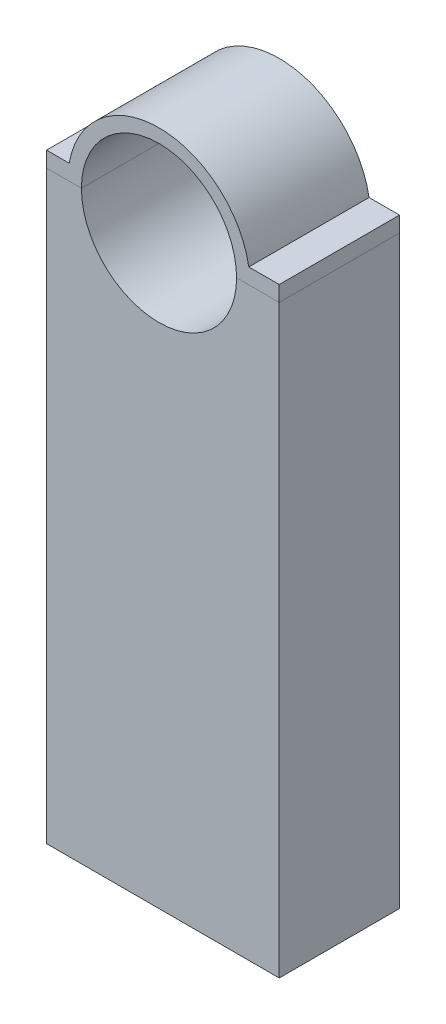
ISO-10303-21;
HEADER;
FILE_DESCRIPTION(('STEP AP214'),'2;1');
FILE_NAME('part.step','',(''),(''),'','','');
FILE_SCHEMA(('AUTOMOTIVE_DESIGN { 1 0 10303 214 1 1 1 1 }'));
ENDSEC;
DATA;
#1=APPLICATION_CONTEXT('core data for automotive mechanical design processes');
#2=APPLICATION_PROTOCOL_DEFINITION('international standard','automotive_design',2000,#1);
#3=PRODUCT_CONTEXT('',#1,'mechanical');
#4=PRODUCT('Part','Part','',(#3));
#5=PRODUCT_RELATED_PRODUCT_CATEGORY('part','',(#4));
#6=PRODUCT_DEFINITION_FORMATION('','',#4);
#7=PRODUCT_DEFINITION_CONTEXT('part definition',#1,'design');
#8=PRODUCT_DEFINITION('design','',#6,#7);
#9=PRODUCT_DEFINITION_SHAPE('','',#8);
#10=(LENGTH_UNIT() NAMED_UNIT(*) SI_UNIT(.MILLI.,.METRE.));
#11=(NAMED_UNIT(*) PLANE_ANGLE_UNIT() SI_UNIT($,.RADIAN.));
#12=(NAMED_UNIT(*) SI_UNIT($,.STERADIAN.) SOLID_ANGLE_UNIT());
#13=UNCERTAINTY_MEASURE_WITH_UNIT(LENGTH_MEASURE(1.E-05),#10,'distance_accuracy_value','');
#14=(GEOMETRIC_REPRESENTATION_CONTEXT(3) GLOBAL_UNCERTAINTY_ASSIGNED_CONTEXT((#13)) GLOBAL_UNIT_ASSIGNED_CONTEXT((#10,
#11,#12)) REPRESENTATION_CONTEXT('',''));
#15=CARTESIAN_POINT('',(0.,0.,0.));
#16=DIRECTION('',(0.,0.,1.));
#17=DIRECTION('',(1.,0.,0.));
#18=AXIS2_PLACEMENT_3D('',#15,#16,#17);
#19=CARTESIAN_POINT('',(-10.020325203252,141.99593495935,0.));
#20=DIRECTION('',(0.,-1.,0.));
#21=DIRECTION('',(0.,0.,-1.));
#22=AXIS2_PLACEMENT_3D('',#19,#20,#21);
#23=PLANE('',#22);
#24=DIRECTION('',(1.,0.,0.));
#25=VECTOR('',#24,1.);
#26=CARTESIAN_POINT('',(-10.020325203252,141.99593495935,31.));
#27=LINE('',#26,#25);
#28=CARTESIAN_POINT('',(-10.020325203252,141.99593495935,31.));
#29=VERTEX_POINT('',#28);
#30=CARTESIAN_POINT('',(-1.02032520325204,141.99593495935,31.));
#31=VERTEX_POINT('',#30);
#32=EDGE_CURVE('E142',#29,#31,#27,.T.);
#33=ORIENTED_EDGE('',*,*,#32,.F.);
#34=DIRECTION('',(0.,0.,1.));
#35=VECTOR('',#34,1.);
#36=CARTESIAN_POINT('',(-10.020325203252,141.99593495935,0.));
#37=LINE('',#36,#35);
#38=CARTESIAN_POINT('',(-10.020325203252,141.99593495935,0.));
#39=VERTEX_POINT('',#38);
#40=EDGE_CURVE('E12',#39,#29,#37,.T.);
#41=ORIENTED_EDGE('',*,*,#40,.F.);
#42=DIRECTION('',(1.,0.,0.));
#43=VECTOR('',#42,1.);
#44=CARTESIAN_POINT('',(-10.020325203252,141.99593495935,0.));
#45=LINE('',#44,#43);
#46=CARTESIAN_POINT('',(-1.02032520325204,141.99593495935,0.));
#47=VERTEX_POINT('',#46);
#48=EDGE_CURVE('E162',#39,#47,#45,.T.);
#49=ORIENTED_EDGE('',*,*,#48,.T.);
#50=DIRECTION('',(0.,0.,1.));
#51=VECTOR('',#50,1.);
#52=CARTESIAN_POINT('',(-1.02032520325204,141.99593495935,0.));
#53=LINE('',#52,#51);
#54=EDGE_CURVE('E48',#47,#31,#53,.T.);
#55=ORIENTED_EDGE('',*,*,#54,.T.);
#56=EDGE_LOOP('',(#33,#41,#49,#55));
#57=FACE_BOUND('',#56,.T.);
#58=ADVANCED_FACE('F45',(#57),#23,.T.);
#59=CARTESIAN_POINT('',(-10.020325203252,141.99593495935,0.));
#60=DIRECTION('',(-1.,0.,0.));
#61=DIRECTION('',(0.,0.,1.));
#62=AXIS2_PLACEMENT_3D('',#59,#60,#61);
#63=PLANE('',#62);
#64=DIRECTION('',(0.,-1.,0.));
#65=VECTOR('',#64,1.);
#66=CARTESIAN_POINT('',(-10.020325203252,141.99593495935,31.));
#67=LINE('',#66,#65);
#68=CARTESIAN_POINT('',(-10.020325203252,145.99593495935,31.));
#69=VERTEX_POINT('',#68);
#70=EDGE_CURVE('E160',#69,#29,#67,.T.);
#71=ORIENTED_EDGE('',*,*,#70,.F.);
#72=DIRECTION('',(0.,0.,1.));
#73=VECTOR('',#72,1.);
#74=CARTESIAN_POINT('',(-10.020325203252,145.99593495935,0.));
#75=LINE('',#74,#73);
#76=CARTESIAN_POINT('',(-10.020325203252,145.99593495935,0.));
#77=VERTEX_POINT('',#76);
#78=EDGE_CURVE('E54',#77,#69,#75,.T.);
#79=ORIENTED_EDGE('',*,*,#78,.F.);
#80=DIRECTION('',(0.,-1.,0.));
#81=VECTOR('',#80,1.);
#82=CARTESIAN_POINT('',(-10.020325203252,141.99593495935,0.));
#83=LINE('',#82,#81);
#84=EDGE_CURVE('E132',#77,#39,#83,.T.);
#85=ORIENTED_EDGE('',*,*,#84,.T.);
#86=ORIENTED_EDGE('',*,*,#40,.T.);
#87=EDGE_LOOP('',(#71,#79,#85,#86));
#88=FACE_BOUND('',#87,.T.);
#89=ADVANCED_FACE('F174',(#88),#63,.T.);
#90=CARTESIAN_POINT('',(-10.020325203252,145.99593495935,0.));
#91=DIRECTION('',(0.,1.,0.));
#92=DIRECTION('',(0.,0.,1.));
#93=AXIS2_PLACEMENT_3D('',#90,#91,#92);
#94=PLANE('',#93);
#95=DIRECTION('',(-1.,0.,0.));
#96=VECTOR('',#95,1.);
#97=CARTESIAN_POINT('',(-10.020325203252,145.99593495935,31.));
#98=LINE('',#97,#96);
#99=CARTESIAN_POINT('',(-4.17739755707086,145.99593495935,31.));
#100=VERTEX_POINT('',#99);
#101=EDGE_CURVE('E119',#100,#69,#98,.T.);
#102=ORIENTED_EDGE('',*,*,#101,.F.);
#103=DIRECTION('',(0.,0.,1.));
#104=VECTOR('',#103,1.);
#105=CARTESIAN_POINT('',(-4.17739755707086,145.99593495935,0.));
#106=LINE('',#105,#104);
#107=CARTESIAN_POINT('',(-4.17739755707086,145.99593495935,0.));
#108=VERTEX_POINT('',#107);
#109=EDGE_CURVE('E114',#108,#100,#106,.T.);
#110=ORIENTED_EDGE('',*,*,#109,.F.);
#111=DIRECTION('',(-1.,0.,0.));
#112=VECTOR('',#111,1.);
#113=CARTESIAN_POINT('',(-10.020325203252,145.99593495935,0.));
#114=LINE('',#113,#112);
#115=EDGE_CURVE('E117',#108,#77,#114,.T.);
#116=ORIENTED_EDGE('',*,*,#115,.T.);
#117=ORIENTED_EDGE('',*,*,#78,.T.);
#118=EDGE_LOOP('',(#102,#110,#116,#117));
#119=FACE_BOUND('',#118,.T.);
#120=ADVANCED_FACE('F116',(#119),#94,.T.);
#121=CARTESIAN_POINT('',(18.979674796748,141.99593495935,0.));
#122=DIRECTION('',(0.,0.,1.));
#123=DIRECTION('',(1.,0.,0.));
#124=AXIS2_PLACEMENT_3D('',#121,#122,#123);
#125=CYLINDRICAL_SURFACE('',#124,23.5);
#126=CARTESIAN_POINT('',(18.979674796748,141.99593495935,31.));
#127=DIRECTION('',(0.,0.,1.));
#128=DIRECTION('',(1.,0.,0.));
#129=AXIS2_PLACEMENT_3D('',#126,#127,#128);
#130=CIRCLE('',#129,23.5);
#131=CARTESIAN_POINT('',(42.1367471505668,145.99593495935,31.));
#132=VERTEX_POINT('',#131);
#133=EDGE_CURVE('E157',#132,#100,#130,.T.);
#134=ORIENTED_EDGE('',*,*,#133,.F.);
#135=DIRECTION('',(0.,0.,1.));
#136=VECTOR('',#135,1.);
#137=CARTESIAN_POINT('',(42.1367471505668,145.99593495935,0.));
#138=LINE('',#137,#136);
#139=CARTESIAN_POINT('',(42.1367471505668,145.99593495935,0.));
#140=VERTEX_POINT('',#139);
#141=EDGE_CURVE('E124',#140,#132,#138,.T.);
#142=ORIENTED_EDGE('',*,*,#141,.F.);
#143=CARTESIAN_POINT('',(18.979674796748,141.99593495935,0.));
#144=DIRECTION('',(0.,0.,1.));
#145=DIRECTION('',(1.,0.,0.));
#146=AXIS2_PLACEMENT_3D('',#143,#144,#145);
#147=CIRCLE('',#146,23.5);
#148=EDGE_CURVE('E130',#140,#108,#147,.T.);
#149=ORIENTED_EDGE('',*,*,#148,.T.);
#150=ORIENTED_EDGE('',*,*,#109,.T.);
#151=EDGE_LOOP('',(#134,#142,#149,#150));
#152=FACE_BOUND('',#151,.T.);
#153=ADVANCED_FACE('F134',(#152),#125,.T.);
#154=CARTESIAN_POINT('',(42.1367471505668,145.99593495935,0.));
#155=DIRECTION('',(0.,1.,0.));
#156=DIRECTION('',(0.,0.,1.));
#157=AXIS2_PLACEMENT_3D('',#154,#155,#156);
#158=PLANE('',#157);
#159=DIRECTION('',(-1.,0.,0.));
#160=VECTOR('',#159,1.);
#161=CARTESIAN_POINT('',(42.1367471505668,145.99593495935,31.));
#162=LINE('',#161,#160);
#163=CARTESIAN_POINT('',(49.979674796748,145.99593495935,31.));
#164=VERTEX_POINT('',#163);
#165=EDGE_CURVE('E154',#164,#132,#162,.T.);
#166=ORIENTED_EDGE('',*,*,#165,.F.);
#167=DIRECTION('',(0.,0.,1.));
#168=VECTOR('',#167,1.);
#169=CARTESIAN_POINT('',(49.979674796748,145.99593495935,0.));
#170=LINE('',#169,#168);
#171=CARTESIAN_POINT('',(49.979674796748,145.99593495935,0.));
#172=VERTEX_POINT('',#171);
#173=EDGE_CURVE('E166',#172,#164,#170,.T.);
#174=ORIENTED_EDGE('',*,*,#173,.F.);
#175=DIRECTION('',(-1.,0.,0.));
#176=VECTOR('',#175,1.);
#177=CARTESIAN_POINT('',(42.1367471505668,145.99593495935,0.));
#178=LINE('',#177,#176);
#179=EDGE_CURVE('E135',#172,#140,#178,.T.);
#180=ORIENTED_EDGE('',*,*,#179,.T.);
#181=ORIENTED_EDGE('',*,*,#141,.T.);
#182=EDGE_LOOP('',(#166,#174,#180,#181));
#183=FACE_BOUND('',#182,.T.);
#184=ADVANCED_FACE('F187',(#183),#158,.T.);
#185=CARTESIAN_POINT('',(49.979674796748,141.99593495935,0.));
#186=DIRECTION('',(1.,0.,0.));
#187=DIRECTION('',(0.,0.,-1.));
#188=AXIS2_PLACEMENT_3D('',#185,#186,#187);
#189=PLANE('',#188);
#190=DIRECTION('',(0.,1.,0.));
#191=VECTOR('',#190,1.);
#192=CARTESIAN_POINT('',(49.979674796748,141.99593495935,31.));
#193=LINE('',#192,#191);
#194=CARTESIAN_POINT('',(49.979674796748,141.99593495935,31.));
#195=VERTEX_POINT('',#194);
#196=EDGE_CURVE('E151',#195,#164,#193,.T.);
#197=ORIENTED_EDGE('',*,*,#196,.F.);
#198=DIRECTION('',(0.,0.,1.));
#199=VECTOR('',#198,1.);
#200=CARTESIAN_POINT('',(49.979674796748,141.99593495935,0.));
#201=LINE('',#200,#199);
#202=CARTESIAN_POINT('',(49.979674796748,141.99593495935,0.));
#203=VERTEX_POINT('',#202);
#204=EDGE_CURVE('E168',#203,#195,#201,.T.);
#205=ORIENTED_EDGE('',*,*,#204,.F.);
#206=DIRECTION('',(0.,1.,0.));
#207=VECTOR('',#206,1.);
#208=CARTESIAN_POINT('',(49.979674796748,141.99593495935,0.));
#209=LINE('',#208,#207);
#210=EDGE_CURVE('E137',#203,#172,#209,.T.);
#211=ORIENTED_EDGE('',*,*,#210,.T.);
#212=ORIENTED_EDGE('',*,*,#173,.T.);
#213=EDGE_LOOP('',(#197,#205,#211,#212));
#214=FACE_BOUND('',#213,.T.);
#215=ADVANCED_FACE('F190',(#214),#189,.T.);
#216=CARTESIAN_POINT('',(38.979674796748,141.99593495935,0.));
#217=DIRECTION('',(0.,-1.,0.));
#218=DIRECTION('',(0.,0.,-1.));
#219=AXIS2_PLACEMENT_3D('',#216,#217,#218);
#220=PLANE('',#219);
#221=DIRECTION('',(1.,0.,0.));
#222=VECTOR('',#221,1.);
#223=CARTESIAN_POINT('',(38.979674796748,141.99593495935,31.));
#224=LINE('',#223,#222);
#225=CARTESIAN_POINT('',(38.979674796748,141.99593495935,31.));
#226=VERTEX_POINT('',#225);
#227=EDGE_CURVE('E148',#226,#195,#224,.T.);
#228=ORIENTED_EDGE('',*,*,#227,.F.);
#229=DIRECTION('',(0.,0.,1.));
#230=VECTOR('',#229,1.);
#231=CARTESIAN_POINT('',(38.979674796748,141.99593495935,0.));
#232=LINE('',#231,#230);
#233=CARTESIAN_POINT('',(38.979674796748,141.99593495935,0.));
#234=VERTEX_POINT('',#233);
#235=EDGE_CURVE('E169',#234,#226,#232,.T.);
#236=ORIENTED_EDGE('',*,*,#235,.F.);
#237=DIRECTION('',(1.,0.,0.));
#238=VECTOR('',#237,1.);
#239=CARTESIAN_POINT('',(38.979674796748,141.99593495935,0.));
#240=LINE('',#239,#238);
#241=EDGE_CURVE('E265',#234,#203,#240,.T.);
#242=ORIENTED_EDGE('',*,*,#241,.T.);
#243=ORIENTED_EDGE('',*,*,#204,.T.);
#244=EDGE_LOOP('',(#228,#236,#242,#243));
#245=FACE_BOUND('',#244,.T.);
#246=ADVANCED_FACE('F194',(#245),#220,.T.);
#247=CARTESIAN_POINT('',(18.979674796748,141.99593495935,0.));
#248=DIRECTION('',(0.,0.,1.));
#249=DIRECTION('',(1.,0.,0.));
#250=AXIS2_PLACEMENT_3D('',#247,#248,#249);
#251=CYLINDRICAL_SURFACE('',#250,20.);
#252=CARTESIAN_POINT('',(18.979674796748,141.99593495935,31.));
#253=DIRECTION('',(0.,0.,-1.));
#254=DIRECTION('',(1.,0.,0.));
#255=AXIS2_PLACEMENT_3D('',#252,#253,#254);
#256=CIRCLE('',#255,20.);
#257=EDGE_CURVE('E145',#31,#226,#256,.T.);
#258=ORIENTED_EDGE('',*,*,#257,.F.);
#259=ORIENTED_EDGE('',*,*,#54,.F.);
#260=CARTESIAN_POINT('',(18.979674796748,141.99593495935,0.));
#261=DIRECTION('',(0.,0.,-1.));
#262=DIRECTION('',(1.,0.,0.));
#263=AXIS2_PLACEMENT_3D('',#260,#261,#262);
#264=CIRCLE('',#263,20.);
#265=EDGE_CURVE('E266',#47,#234,#264,.T.);
#266=ORIENTED_EDGE('',*,*,#265,.T.);
#267=ORIENTED_EDGE('',*,*,#235,.T.);
#268=EDGE_LOOP('',(#258,#259,#266,#267));
#269=FACE_BOUND('',#268,.T.);
#270=ADVANCED_FACE('F171',(#269),#251,.F.);
#271=CARTESIAN_POINT('',(18.979674796748,141.99593495935,0.));
#272=DIRECTION('',(0.,0.,1.));
#273=DIRECTION('',(1.,0.,0.));
#274=AXIS2_PLACEMENT_3D('',#271,#272,#273);
#275=PLANE('',#274);
#276=ORIENTED_EDGE('',*,*,#48,.F.);
#277=ORIENTED_EDGE('',*,*,#84,.F.);
#278=ORIENTED_EDGE('',*,*,#115,.F.);
#279=ORIENTED_EDGE('',*,*,#148,.F.);
#280=ORIENTED_EDGE('',*,*,#179,.F.);
#281=ORIENTED_EDGE('',*,*,#210,.F.);
#282=ORIENTED_EDGE('',*,*,#241,.F.);
#283=ORIENTED_EDGE('',*,*,#265,.F.);
#284=EDGE_LOOP('',(#276,#277,#278,#279,#280,#281,#282,#283));
#285=FACE_BOUND('',#284,.T.);
#286=ADVANCED_FACE('F128',(#285),#275,.F.);
#287=CARTESIAN_POINT('',(18.979674796748,141.99593495935,31.));
#288=DIRECTION('',(0.,0.,1.));
#289=DIRECTION('',(1.,0.,0.));
#290=AXIS2_PLACEMENT_3D('',#287,#288,#289);
#291=PLANE('',#290);
#292=ORIENTED_EDGE('',*,*,#32,.T.);
#293=ORIENTED_EDGE('',*,*,#257,.T.);
#294=ORIENTED_EDGE('',*,*,#227,.T.);
#295=ORIENTED_EDGE('',*,*,#196,.T.);
#296=ORIENTED_EDGE('',*,*,#165,.T.);
#297=ORIENTED_EDGE('',*,*,#133,.T.);
#298=ORIENTED_EDGE('',*,*,#101,.T.);
#299=ORIENTED_EDGE('',*,*,#70,.T.);
#300=EDGE_LOOP('',(#292,#293,#294,#295,#296,#297,#298,#299));
#301=FACE_BOUND('',#300,.T.);
#302=ADVANCED_FACE('F173',(#301),#291,.T.);
#303=CLOSED_SHELL('',(#58,#89,#120,#153,#184,#215,#246,#270,#286,#302));
#304=MANIFOLD_SOLID_BREP('B2',#303);
#305=CARTESIAN_POINT('',(-10.020325203252,141.99593495935,31.));
#306=DIRECTION('',(1.,0.,0.));
#307=DIRECTION('',(0.,1.,0.));
#308=AXIS2_PLACEMENT_3D('',#305,#306,#307);
#309=PLANE('',#308);
#310=DIRECTION('',(0.,-1.,0.));
#311=VECTOR('',#310,1.);
#312=CARTESIAN_POINT('',(-10.020325203252,141.99593495935,0.));
#313=LINE('',#312,#311);
#314=CARTESIAN_POINT('',(-10.020325203252,141.99593495935,0.));
#315=VERTEX_POINT('',#314);
#316=CARTESIAN_POINT('',(-10.020325203252,-8.84406504065041,0.));
#317=VERTEX_POINT('',#316);
#318=EDGE_CURVE('E356',#315,#317,#313,.T.);
#319=ORIENTED_EDGE('',*,*,#318,.T.);
#320=DIRECTION('',(0.,0.,-1.));
#321=VECTOR('',#320,1.);
#322=CARTESIAN_POINT('',(-10.020325203252,-8.84406504065041,31.));
#323=LINE('',#322,#321);
#324=CARTESIAN_POINT('',(-10.020325203252,-8.84406504065041,31.));
#325=VERTEX_POINT('',#324);
#326=EDGE_CURVE('E43',#325,#317,#323,.T.);
#327=ORIENTED_EDGE('',*,*,#326,.F.);
#328=DIRECTION('',(0.,-1.,0.));
#329=VECTOR('',#328,1.);
#330=CARTESIAN_POINT('',(-10.020325203252,141.99593495935,31.));
#331=LINE('',#330,#329);
#332=CARTESIAN_POINT('',(-10.020325203252,141.99593495935,31.));
#333=VERTEX_POINT('',#332);
#334=EDGE_CURVE('E366',#333,#325,#331,.T.);
#335=ORIENTED_EDGE('',*,*,#334,.F.);
#336=DIRECTION('',(0.,0.,-1.));
#337=VECTOR('',#336,1.);
#338=CARTESIAN_POINT('',(-10.020325203252,141.99593495935,31.));
#339=LINE('',#338,#337);
#340=EDGE_CURVE('E352',#333,#315,#339,.T.);
#341=ORIENTED_EDGE('',*,*,#340,.T.);
#342=EDGE_LOOP('',(#319,#327,#335,#341));
#343=FACE_BOUND('',#342,.T.);
#344=ADVANCED_FACE('F272',(#343),#309,.F.);
#345=CARTESIAN_POINT('',(-10.020325203252,-8.84406504065041,31.));
#346=DIRECTION('',(0.,1.,0.));
#347=DIRECTION('',(0.,0.,1.));
#348=AXIS2_PLACEMENT_3D('',#345,#346,#347);
#349=PLANE('',#348);
#350=DIRECTION('',(1.,0.,0.));
#351=VECTOR('',#350,1.);
#352=CARTESIAN_POINT('',(-10.020325203252,-8.84406504065041,0.));
#353=LINE('',#352,#351);
#354=CARTESIAN_POINT('',(49.979674796748,-8.84406504065041,0.));
#355=VERTEX_POINT('',#354);
#356=EDGE_CURVE('E359',#317,#355,#353,.T.);
#357=ORIENTED_EDGE('',*,*,#356,.T.);
#358=DIRECTION('',(0.,0.,-1.));
#359=VECTOR('',#358,1.);
#360=CARTESIAN_POINT('',(49.979674796748,-8.84406504065041,31.));
#361=LINE('',#360,#359);
#362=CARTESIAN_POINT('',(49.979674796748,-8.84406504065041,31.));
#363=VERTEX_POINT('',#362);
#364=EDGE_CURVE('E280',#363,#355,#361,.T.);
#365=ORIENTED_EDGE('',*,*,#364,.F.);
#366=DIRECTION('',(1.,0.,0.));
#367=VECTOR('',#366,1.);
#368=CARTESIAN_POINT('',(-10.020325203252,-8.84406504065041,31.));
#369=LINE('',#368,#367);
#370=EDGE_CURVE('E325',#325,#363,#369,.T.);
#371=ORIENTED_EDGE('',*,*,#370,.F.);
#372=ORIENTED_EDGE('',*,*,#326,.T.);
#373=EDGE_LOOP('',(#357,#365,#371,#372));
#374=FACE_BOUND('',#373,.T.);
#375=ADVANCED_FACE('F390',(#374),#349,.F.);
#376=CARTESIAN_POINT('',(49.979674796748,141.99593495935,31.));
#377=DIRECTION('',(-1.,0.,0.));
#378=DIRECTION('',(0.,-1.,0.));
#379=AXIS2_PLACEMENT_3D('',#376,#377,#378);
#380=PLANE('',#379);
#381=DIRECTION('',(0.,1.,0.));
#382=VECTOR('',#381,1.);
#383=CARTESIAN_POINT('',(49.979674796748,141.99593495935,0.));
#384=LINE('',#383,#382);
#385=CARTESIAN_POINT('',(49.979674796748,141.99593495935,0.));
#386=VERTEX_POINT('',#385);
#387=EDGE_CURVE('E361',#355,#386,#384,.T.);
#388=ORIENTED_EDGE('',*,*,#387,.T.);
#389=DIRECTION('',(0.,0.,-1.));
#390=VECTOR('',#389,1.);
#391=CARTESIAN_POINT('',(49.979674796748,141.99593495935,31.));
#392=LINE('',#391,#390);
#393=CARTESIAN_POINT('',(49.979674796748,141.99593495935,31.));
#394=VERTEX_POINT('',#393);
#395=EDGE_CURVE('E347',#394,#386,#392,.T.);
#396=ORIENTED_EDGE('',*,*,#395,.F.);
#397=DIRECTION('',(0.,1.,0.));
#398=VECTOR('',#397,1.);
#399=CARTESIAN_POINT('',(49.979674796748,141.99593495935,31.));
#400=LINE('',#399,#398);
#401=EDGE_CURVE('E338',#363,#394,#400,.T.);
#402=ORIENTED_EDGE('',*,*,#401,.F.);
#403=ORIENTED_EDGE('',*,*,#364,.T.);
#404=EDGE_LOOP('',(#388,#396,#402,#403));
#405=FACE_BOUND('',#404,.T.);
#406=ADVANCED_FACE('F372',(#405),#380,.F.);
#407=CARTESIAN_POINT('',(38.979674796748,141.99593495935,31.));
#408=DIRECTION('',(0.,-1.,0.));
#409=DIRECTION('',(0.,0.,-1.));
#410=AXIS2_PLACEMENT_3D('',#407,#408,#409);
#411=PLANE('',#410);
#412=DIRECTION('',(-1.,0.,0.));
#413=VECTOR('',#412,1.);
#414=CARTESIAN_POINT('',(38.979674796748,141.99593495935,0.));
#415=LINE('',#414,#413);
#416=CARTESIAN_POINT('',(38.979674796748,141.99593495935,0.));
#417=VERTEX_POINT('',#416);
#418=EDGE_CURVE('E346',#386,#417,#415,.T.);
#419=ORIENTED_EDGE('',*,*,#418,.T.);
#420=DIRECTION('',(0.,0.,-1.));
#421=VECTOR('',#420,1.);
#422=CARTESIAN_POINT('',(38.979674796748,141.99593495935,31.));
#423=LINE('',#422,#421);
#424=CARTESIAN_POINT('',(38.979674796748,141.99593495935,31.));
#425=VERTEX_POINT('',#424);
#426=EDGE_CURVE('E343',#425,#417,#423,.T.);
#427=ORIENTED_EDGE('',*,*,#426,.F.);
#428=DIRECTION('',(-1.,0.,0.));
#429=VECTOR('',#428,1.);
#430=CARTESIAN_POINT('',(38.979674796748,141.99593495935,31.));
#431=LINE('',#430,#429);
#432=EDGE_CURVE('E332',#394,#425,#431,.T.);
#433=ORIENTED_EDGE('',*,*,#432,.F.);
#434=ORIENTED_EDGE('',*,*,#395,.T.);
#435=EDGE_LOOP('',(#419,#427,#433,#434));
#436=FACE_BOUND('',#435,.T.);
#437=ADVANCED_FACE('F344',(#436),#411,.F.);
#438=CARTESIAN_POINT('',(18.979674796748,141.99593495935,31.));
#439=DIRECTION('',(0.,0.,-1.));
#440=DIRECTION('',(-1.,0.,0.));
#441=AXIS2_PLACEMENT_3D('',#438,#439,#440);
#442=CYLINDRICAL_SURFACE('',#441,20.);
#443=CARTESIAN_POINT('',(18.979674796748,141.99593495935,0.));
#444=DIRECTION('',(0.,0.,-1.));
#445=DIRECTION('',(1.,0.,0.));
#446=AXIS2_PLACEMENT_3D('',#443,#444,#445);
#447=CIRCLE('',#446,20.);
#448=CARTESIAN_POINT('',(-1.02032520325204,141.99593495935,0.));
#449=VERTEX_POINT('',#448);
#450=EDGE_CURVE('E311',#417,#449,#447,.T.);
#451=ORIENTED_EDGE('',*,*,#450,.T.);
#452=DIRECTION('',(0.,0.,-1.));
#453=VECTOR('',#452,1.);
#454=CARTESIAN_POINT('',(-1.02032520325204,141.99593495935,31.));
#455=LINE('',#454,#453);
#456=CARTESIAN_POINT('',(-1.02032520325204,141.99593495935,31.));
#457=VERTEX_POINT('',#456);
#458=EDGE_CURVE('E348',#457,#449,#455,.T.);
#459=ORIENTED_EDGE('',*,*,#458,.F.);
#460=CARTESIAN_POINT('',(18.979674796748,141.99593495935,31.));
#461=DIRECTION('',(0.,0.,-1.));
#462=DIRECTION('',(1.,0.,0.));
#463=AXIS2_PLACEMENT_3D('',#460,#461,#462);
#464=CIRCLE('',#463,20.);
#465=EDGE_CURVE('E336',#425,#457,#464,.T.);
#466=ORIENTED_EDGE('',*,*,#465,.F.);
#467=ORIENTED_EDGE('',*,*,#426,.T.);
#468=EDGE_LOOP('',(#451,#459,#466,#467));
#469=FACE_BOUND('',#468,.T.);
#470=ADVANCED_FACE('F350',(#469),#442,.F.);
#471=CARTESIAN_POINT('',(-10.020325203252,141.99593495935,31.));
#472=DIRECTION('',(0.,-1.,0.));
#473=DIRECTION('',(0.,0.,-1.));
#474=AXIS2_PLACEMENT_3D('',#471,#472,#473);
#475=PLANE('',#474);
#476=DIRECTION('',(-1.,0.,0.));
#477=VECTOR('',#476,1.);
#478=CARTESIAN_POINT('',(-10.020325203252,141.99593495935,0.));
#479=LINE('',#478,#477);
#480=EDGE_CURVE('E317',#449,#315,#479,.T.);
#481=ORIENTED_EDGE('',*,*,#480,.T.);
#482=ORIENTED_EDGE('',*,*,#340,.F.);
#483=DIRECTION('',(-1.,0.,0.));
#484=VECTOR('',#483,1.);
#485=CARTESIAN_POINT('',(-10.020325203252,141.99593495935,31.));
#486=LINE('',#485,#484);
#487=EDGE_CURVE('E288',#457,#333,#486,.T.);
#488=ORIENTED_EDGE('',*,*,#487,.F.);
#489=ORIENTED_EDGE('',*,*,#458,.T.);
#490=EDGE_LOOP('',(#481,#482,#488,#489));
#491=FACE_BOUND('',#490,.T.);
#492=ADVANCED_FACE('F379',(#491),#475,.F.);
#493=CARTESIAN_POINT('',(18.979674796748,141.99593495935,31.));
#494=DIRECTION('',(0.,0.,1.));
#495=DIRECTION('',(1.,0.,0.));
#496=AXIS2_PLACEMENT_3D('',#493,#494,#495);
#497=PLANE('',#496);
#498=ORIENTED_EDGE('',*,*,#334,.T.);
#499=ORIENTED_EDGE('',*,*,#370,.T.);
#500=ORIENTED_EDGE('',*,*,#401,.T.);
#501=ORIENTED_EDGE('',*,*,#432,.T.);
#502=ORIENTED_EDGE('',*,*,#465,.T.);
#503=ORIENTED_EDGE('',*,*,#487,.T.);
#504=EDGE_LOOP('',(#498,#499,#500,#501,#502,#503));
#505=FACE_BOUND('',#504,.T.);
#506=ADVANCED_FACE('F334',(#505),#497,.T.);
#507=CARTESIAN_POINT('',(18.979674796748,141.99593495935,0.));
#508=DIRECTION('',(0.,0.,1.));
#509=DIRECTION('',(1.,0.,0.));
#510=AXIS2_PLACEMENT_3D('',#507,#508,#509);
#511=PLANE('',#510);
#512=ORIENTED_EDGE('',*,*,#318,.F.);
#513=ORIENTED_EDGE('',*,*,#480,.F.);
#514=ORIENTED_EDGE('',*,*,#450,.F.);
#515=ORIENTED_EDGE('',*,*,#418,.F.);
#516=ORIENTED_EDGE('',*,*,#387,.F.);
#517=ORIENTED_EDGE('',*,*,#356,.F.);
#518=EDGE_LOOP('',(#512,#513,#514,#515,#516,#517));
#519=FACE_BOUND('',#518,.T.);
#520=ADVANCED_FACE('F375',(#519),#511,.F.);
#521=CLOSED_SHELL('',(#344,#375,#406,#437,#470,#492,#506,#520));
#522=MANIFOLD_SOLID_BREP('B6',#521);
#523=ADVANCED_BREP_SHAPE_REPRESENTATION('',(#18,#304,#522),#14);
#524=SHAPE_DEFINITION_REPRESENTATION(#9,#523);
ENDSEC;
END-ISO-10303-21;
